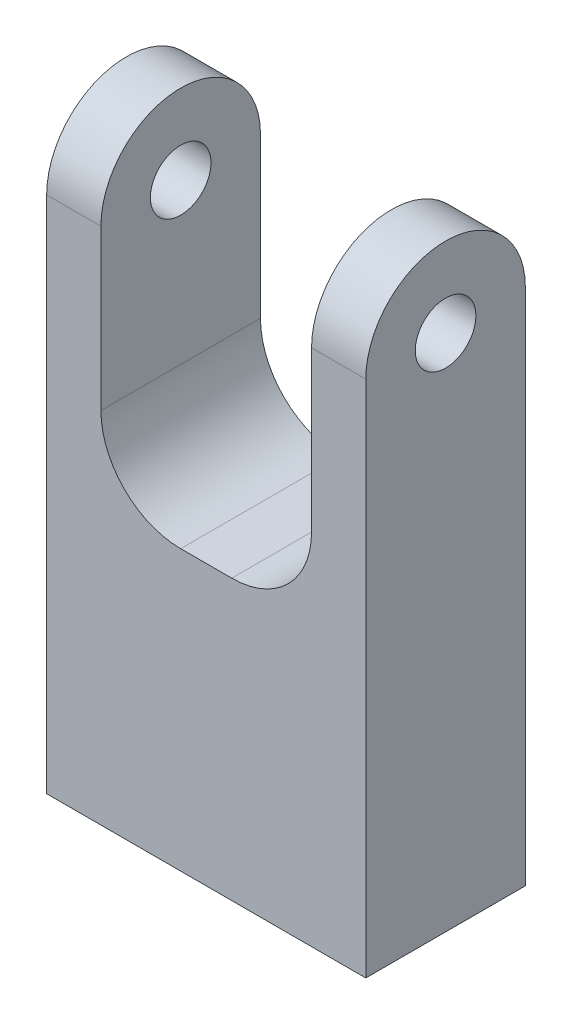
ISO-10303-21;
HEADER;
FILE_DESCRIPTION(('STEP AP214'),'2;1');
FILE_NAME('part.step','',(''),(''),'','','');
FILE_SCHEMA(('AUTOMOTIVE_DESIGN { 1 0 10303 214 1 1 1 1 }'));
ENDSEC;
DATA;
#1=APPLICATION_CONTEXT('core data for automotive mechanical design processes');
#2=APPLICATION_PROTOCOL_DEFINITION('international standard','automotive_design',2000,#1);
#3=PRODUCT_CONTEXT('',#1,'mechanical');
#4=PRODUCT('Part','Part','',(#3));
#5=PRODUCT_RELATED_PRODUCT_CATEGORY('part','',(#4));
#6=PRODUCT_DEFINITION_FORMATION('','',#4);
#7=PRODUCT_DEFINITION_CONTEXT('part definition',#1,'design');
#8=PRODUCT_DEFINITION('design','',#6,#7);
#9=PRODUCT_DEFINITION_SHAPE('','',#8);
#10=(LENGTH_UNIT() NAMED_UNIT(*) SI_UNIT(.MILLI.,.METRE.));
#11=(NAMED_UNIT(*) PLANE_ANGLE_UNIT() SI_UNIT($,.RADIAN.));
#12=(NAMED_UNIT(*) SI_UNIT($,.STERADIAN.) SOLID_ANGLE_UNIT());
#13=UNCERTAINTY_MEASURE_WITH_UNIT(LENGTH_MEASURE(1.E-05),#10,'distance_accuracy_value','');
#14=(GEOMETRIC_REPRESENTATION_CONTEXT(3) GLOBAL_UNCERTAINTY_ASSIGNED_CONTEXT((#13)) GLOBAL_UNIT_ASSIGNED_CONTEXT((#10,
#11,#12)) REPRESENTATION_CONTEXT('',''));
#15=CARTESIAN_POINT('',(0.,0.,0.));
#16=DIRECTION('',(0.,0.,1.));
#17=DIRECTION('',(1.,0.,0.));
#18=AXIS2_PLACEMENT_3D('',#15,#16,#17);
#19=CARTESIAN_POINT('',(8.38199999999999,41.275,0.));
#20=DIRECTION('',(-1.,0.,0.));
#21=DIRECTION('',(0.,-1.,0.));
#22=AXIS2_PLACEMENT_3D('',#19,#20,#21);
#23=CYLINDRICAL_SURFACE('',#22,6.35);
#24=DIRECTION('',(1.,0.,0.));
#25=VECTOR('',#24,1.);
#26=CARTESIAN_POINT('',(8.38199999999999,41.275,-6.35));
#27=LINE('',#26,#25);
#28=CARTESIAN_POINT('',(8.38199999999999,41.275,-6.35));
#29=VERTEX_POINT('',#28);
#30=CARTESIAN_POINT('',(12.7,41.275,-6.35));
#31=VERTEX_POINT('',#30);
#32=EDGE_CURVE('E214',#29,#31,#27,.T.);
#33=ORIENTED_EDGE('',*,*,#32,.F.);
#34=CARTESIAN_POINT('',(8.38199999999999,41.275,0.));
#35=DIRECTION('',(1.,0.,0.));
#36=DIRECTION('',(0.,1.,0.));
#37=AXIS2_PLACEMENT_3D('',#34,#35,#36);
#38=CIRCLE('',#37,6.35);
#39=CARTESIAN_POINT('',(8.38199999999999,41.275,6.35));
#40=VERTEX_POINT('',#39);
#41=EDGE_CURVE('E50',#40,#29,#38,.F.);
#42=ORIENTED_EDGE('',*,*,#41,.F.);
#43=DIRECTION('',(-1.,0.,0.));
#44=VECTOR('',#43,1.);
#45=CARTESIAN_POINT('',(0.,41.275,6.35));
#46=LINE('',#45,#44);
#47=CARTESIAN_POINT('',(12.7,41.275,6.35));
#48=VERTEX_POINT('',#47);
#49=EDGE_CURVE('E217',#48,#40,#46,.T.);
#50=ORIENTED_EDGE('',*,*,#49,.F.);
#51=CARTESIAN_POINT('',(12.7,41.275,0.));
#52=DIRECTION('',(-1.,0.,0.));
#53=DIRECTION('',(0.,-1.,0.));
#54=AXIS2_PLACEMENT_3D('',#51,#52,#53);
#55=CIRCLE('',#54,6.35);
#56=EDGE_CURVE('E11',#31,#48,#55,.F.);
#57=ORIENTED_EDGE('',*,*,#56,.F.);
#58=EDGE_LOOP('',(#33,#42,#50,#57));
#59=FACE_BOUND('',#58,.T.);
#60=ADVANCED_FACE('F42',(#59),#23,.T.);
#61=CARTESIAN_POINT('',(-12.7,41.275,0.));
#62=DIRECTION('',(-1.,0.,0.));
#63=DIRECTION('',(0.,-1.,0.));
#64=AXIS2_PLACEMENT_3D('',#61,#62,#63);
#65=CYLINDRICAL_SURFACE('',#64,6.35);
#66=DIRECTION('',(1.,0.,0.));
#67=VECTOR('',#66,1.);
#68=CARTESIAN_POINT('',(-12.7,41.275,-6.35));
#69=LINE('',#68,#67);
#70=CARTESIAN_POINT('',(-12.7,41.275,-6.35));
#71=VERTEX_POINT('',#70);
#72=CARTESIAN_POINT('',(-8.38199999999999,41.275,-6.35));
#73=VERTEX_POINT('',#72);
#74=EDGE_CURVE('E203',#71,#73,#69,.T.);
#75=ORIENTED_EDGE('',*,*,#74,.F.);
#76=CARTESIAN_POINT('',(-12.7,41.275,0.));
#77=DIRECTION('',(1.,0.,0.));
#78=DIRECTION('',(0.,1.,0.));
#79=AXIS2_PLACEMENT_3D('',#76,#77,#78);
#80=CIRCLE('',#79,6.35);
#81=CARTESIAN_POINT('',(-12.7,41.275,6.35));
#82=VERTEX_POINT('',#81);
#83=EDGE_CURVE('E212',#82,#71,#80,.F.);
#84=ORIENTED_EDGE('',*,*,#83,.F.);
#85=DIRECTION('',(-1.,0.,0.));
#86=VECTOR('',#85,1.);
#87=CARTESIAN_POINT('',(0.,41.275,6.35));
#88=LINE('',#87,#86);
#89=CARTESIAN_POINT('',(-8.38199999999999,41.275,6.35));
#90=VERTEX_POINT('',#89);
#91=EDGE_CURVE('E209',#90,#82,#88,.T.);
#92=ORIENTED_EDGE('',*,*,#91,.F.);
#93=CARTESIAN_POINT('',(-8.38199999999999,41.275,0.));
#94=DIRECTION('',(-1.,0.,0.));
#95=DIRECTION('',(0.,-1.,0.));
#96=AXIS2_PLACEMENT_3D('',#93,#94,#95);
#97=CIRCLE('',#96,6.35);
#98=EDGE_CURVE('E206',#73,#90,#97,.F.);
#99=ORIENTED_EDGE('',*,*,#98,.F.);
#100=EDGE_LOOP('',(#75,#84,#92,#99));
#101=FACE_BOUND('',#100,.T.);
#102=ADVANCED_FACE('F247',(#101),#65,.T.);
#103=CARTESIAN_POINT('',(-12.7,0.,6.35));
#104=DIRECTION('',(1.,0.,0.));
#105=DIRECTION('',(0.,1.,0.));
#106=AXIS2_PLACEMENT_3D('',#103,#104,#105);
#107=PLANE('',#106);
#108=CARTESIAN_POINT('',(-12.7,41.275,0.));
#109=DIRECTION('',(1.,0.,0.));
#110=DIRECTION('',(0.,0.,-1.));
#111=AXIS2_PLACEMENT_3D('',#108,#109,#110);
#112=CIRCLE('',#111,2.41299999999999);
#113=CARTESIAN_POINT('',(-12.7,41.275,-2.41299999999999));
#114=VERTEX_POINT('',#113);
#115=EDGE_CURVE('E183',#114,#114,#112,.T.);
#116=ORIENTED_EDGE('',*,*,#115,.T.);
#117=EDGE_LOOP('',(#116));
#118=FACE_BOUND('',#117,.T.);
#119=DIRECTION('',(0.,-1.,0.));
#120=VECTOR('',#119,1.);
#121=CARTESIAN_POINT('',(-12.7,0.,6.35));
#122=LINE('',#121,#120);
#123=CARTESIAN_POINT('',(-12.7,0.,6.35));
#124=VERTEX_POINT('',#123);
#125=EDGE_CURVE('E145',#82,#124,#122,.T.);
#126=ORIENTED_EDGE('',*,*,#125,.F.);
#127=ORIENTED_EDGE('',*,*,#83,.T.);
#128=DIRECTION('',(0.,-1.,0.));
#129=VECTOR('',#128,1.);
#130=CARTESIAN_POINT('',(-12.7,0.,-6.35));
#131=LINE('',#130,#129);
#132=CARTESIAN_POINT('',(-12.7,0.,-6.35));
#133=VERTEX_POINT('',#132);
#134=EDGE_CURVE('E144',#71,#133,#131,.T.);
#135=ORIENTED_EDGE('',*,*,#134,.T.);
#136=DIRECTION('',(0.,0.,-1.));
#137=VECTOR('',#136,1.);
#138=CARTESIAN_POINT('',(-12.7,0.,6.35));
#139=LINE('',#138,#137);
#140=EDGE_CURVE('E176',#124,#133,#139,.T.);
#141=ORIENTED_EDGE('',*,*,#140,.F.);
#142=EDGE_LOOP('',(#126,#127,#135,#141));
#143=FACE_BOUND('',#142,.T.);
#144=ADVANCED_FACE('F253',(#118,#143),#107,.F.);
#145=CARTESIAN_POINT('',(-12.7,0.,6.35));
#146=DIRECTION('',(0.,1.,0.));
#147=DIRECTION('',(-1.,0.,0.));
#148=AXIS2_PLACEMENT_3D('',#145,#146,#147);
#149=PLANE('',#148);
#150=CARTESIAN_POINT('',(9.525,0.,0.));
#151=DIRECTION('',(0.,-1.,0.));
#152=DIRECTION('',(0.,0.,-1.));
#153=AXIS2_PLACEMENT_3D('',#150,#151,#152);
#154=CIRCLE('',#153,1.35254999999999);
#155=CARTESIAN_POINT('',(9.525,0.,-1.35254999999999));
#156=VERTEX_POINT('',#155);
#157=EDGE_CURVE('E132',#156,#156,#154,.T.);
#158=ORIENTED_EDGE('',*,*,#157,.F.);
#159=EDGE_LOOP('',(#158));
#160=FACE_BOUND('',#159,.T.);
#161=CARTESIAN_POINT('',(-9.525,0.,0.));
#162=DIRECTION('',(0.,-1.,0.));
#163=DIRECTION('',(0.,0.,-1.));
#164=AXIS2_PLACEMENT_3D('',#161,#162,#163);
#165=CIRCLE('',#164,1.35254999999999);
#166=CARTESIAN_POINT('',(-9.525,0.,-1.35254999999999));
#167=VERTEX_POINT('',#166);
#168=EDGE_CURVE('E131',#167,#167,#165,.T.);
#169=ORIENTED_EDGE('',*,*,#168,.F.);
#170=EDGE_LOOP('',(#169));
#171=FACE_BOUND('',#170,.T.);
#172=DIRECTION('',(1.,0.,0.));
#173=VECTOR('',#172,1.);
#174=CARTESIAN_POINT('',(-12.7,0.,-6.35));
#175=LINE('',#174,#173);
#176=CARTESIAN_POINT('',(12.7,0.,-6.35));
#177=VERTEX_POINT('',#176);
#178=EDGE_CURVE('E163',#133,#177,#175,.T.);
#179=ORIENTED_EDGE('',*,*,#178,.T.);
#180=DIRECTION('',(0.,0.,-1.));
#181=VECTOR('',#180,1.);
#182=CARTESIAN_POINT('',(12.7,0.,6.35));
#183=LINE('',#182,#181);
#184=CARTESIAN_POINT('',(12.7,0.,6.35));
#185=VERTEX_POINT('',#184);
#186=EDGE_CURVE('E161',#185,#177,#183,.T.);
#187=ORIENTED_EDGE('',*,*,#186,.F.);
#188=DIRECTION('',(1.,0.,0.));
#189=VECTOR('',#188,1.);
#190=CARTESIAN_POINT('',(-12.7,0.,6.35));
#191=LINE('',#190,#189);
#192=EDGE_CURVE('E147',#124,#185,#191,.T.);
#193=ORIENTED_EDGE('',*,*,#192,.F.);
#194=ORIENTED_EDGE('',*,*,#140,.T.);
#195=EDGE_LOOP('',(#179,#187,#193,#194));
#196=FACE_BOUND('',#195,.T.);
#197=ADVANCED_FACE('F257',(#160,#171,#196),#149,.F.);
#198=CARTESIAN_POINT('',(12.7,0.,6.35));
#199=DIRECTION('',(-1.,0.,0.));
#200=DIRECTION('',(0.,-1.,0.));
#201=AXIS2_PLACEMENT_3D('',#198,#199,#200);
#202=PLANE('',#201);
#203=CARTESIAN_POINT('',(12.7,41.275,0.));
#204=DIRECTION('',(1.,0.,0.));
#205=DIRECTION('',(0.,0.,-1.));
#206=AXIS2_PLACEMENT_3D('',#203,#204,#205);
#207=CIRCLE('',#206,2.413);
#208=CARTESIAN_POINT('',(12.7,41.275,-2.413));
#209=VERTEX_POINT('',#208);
#210=EDGE_CURVE('E429',#209,#209,#207,.T.);
#211=ORIENTED_EDGE('',*,*,#210,.F.);
#212=EDGE_LOOP('',(#211));
#213=FACE_BOUND('',#212,.T.);
#214=DIRECTION('',(0.,1.,0.));
#215=VECTOR('',#214,1.);
#216=CARTESIAN_POINT('',(12.7,0.,-6.35));
#217=LINE('',#216,#215);
#218=EDGE_CURVE('E165',#177,#31,#217,.T.);
#219=ORIENTED_EDGE('',*,*,#218,.T.);
#220=ORIENTED_EDGE('',*,*,#56,.T.);
#221=DIRECTION('',(0.,1.,0.));
#222=VECTOR('',#221,1.);
#223=CARTESIAN_POINT('',(12.7,0.,6.35));
#224=LINE('',#223,#222);
#225=EDGE_CURVE('E150',#185,#48,#224,.T.);
#226=ORIENTED_EDGE('',*,*,#225,.F.);
#227=ORIENTED_EDGE('',*,*,#186,.T.);
#228=EDGE_LOOP('',(#219,#220,#226,#227));
#229=FACE_BOUND('',#228,.T.);
#230=ADVANCED_FACE('F258',(#213,#229),#202,.F.);
#231=CARTESIAN_POINT('',(8.38199999999999,47.625,6.35));
#232=DIRECTION('',(1.,0.,0.));
#233=DIRECTION('',(0.,1.,0.));
#234=AXIS2_PLACEMENT_3D('',#231,#232,#233);
#235=PLANE('',#234);
#236=CARTESIAN_POINT('',(8.38199999999999,41.275,0.));
#237=DIRECTION('',(1.,0.,0.));
#238=DIRECTION('',(0.,1.,0.));
#239=AXIS2_PLACEMENT_3D('',#236,#237,#238);
#240=CIRCLE('',#239,2.41299999999999);
#241=CARTESIAN_POINT('',(8.38199999999999,43.688,0.));
#242=VERTEX_POINT('',#241);
#243=EDGE_CURVE('E180',#242,#242,#240,.T.);
#244=ORIENTED_EDGE('',*,*,#243,.T.);
#245=EDGE_LOOP('',(#244));
#246=FACE_BOUND('',#245,.T.);
#247=DIRECTION('',(0.,-1.,0.));
#248=VECTOR('',#247,1.);
#249=CARTESIAN_POINT('',(8.38199999999999,47.625,6.35));
#250=LINE('',#249,#248);
#251=CARTESIAN_POINT('',(8.38199999999999,28.575,6.35));
#252=VERTEX_POINT('',#251);
#253=EDGE_CURVE('E153',#40,#252,#250,.T.);
#254=ORIENTED_EDGE('',*,*,#253,.F.);
#255=ORIENTED_EDGE('',*,*,#41,.T.);
#256=DIRECTION('',(0.,-1.,0.));
#257=VECTOR('',#256,1.);
#258=CARTESIAN_POINT('',(8.38199999999999,47.625,-6.35));
#259=LINE('',#258,#257);
#260=CARTESIAN_POINT('',(8.38199999999999,28.575,-6.35));
#261=VERTEX_POINT('',#260);
#262=EDGE_CURVE('E167',#29,#261,#259,.T.);
#263=ORIENTED_EDGE('',*,*,#262,.T.);
#264=DIRECTION('',(0.,0.,-1.));
#265=VECTOR('',#264,1.);
#266=CARTESIAN_POINT('',(8.38199999999999,28.575,6.35));
#267=LINE('',#266,#265);
#268=EDGE_CURVE('E191',#261,#252,#267,.F.);
#269=ORIENTED_EDGE('',*,*,#268,.T.);
#270=EDGE_LOOP('',(#254,#255,#263,#269));
#271=FACE_BOUND('',#270,.T.);
#272=ADVANCED_FACE('F220',(#246,#271),#235,.F.);
#273=CARTESIAN_POINT('',(-8.38199999999999,22.225,6.35));
#274=DIRECTION('',(0.,-1.,0.));
#275=DIRECTION('',(1.,0.,0.));
#276=AXIS2_PLACEMENT_3D('',#273,#274,#275);
#277=PLANE('',#276);
#278=DIRECTION('',(-1.,0.,0.));
#279=VECTOR('',#278,1.);
#280=CARTESIAN_POINT('',(-8.38199999999999,22.225,-6.35));
#281=LINE('',#280,#279);
#282=CARTESIAN_POINT('',(2.03199999999999,22.225,-6.35));
#283=VERTEX_POINT('',#282);
#284=CARTESIAN_POINT('',(-2.03199999999999,22.225,-6.35));
#285=VERTEX_POINT('',#284);
#286=EDGE_CURVE('E169',#283,#285,#281,.T.);
#287=ORIENTED_EDGE('',*,*,#286,.T.);
#288=DIRECTION('',(0.,0.,-1.));
#289=VECTOR('',#288,1.);
#290=CARTESIAN_POINT('',(-2.03199999999999,22.225,6.35));
#291=LINE('',#290,#289);
#292=CARTESIAN_POINT('',(-2.03199999999999,22.225,6.35));
#293=VERTEX_POINT('',#292);
#294=EDGE_CURVE('E189',#285,#293,#291,.F.);
#295=ORIENTED_EDGE('',*,*,#294,.T.);
#296=DIRECTION('',(-1.,0.,0.));
#297=VECTOR('',#296,1.);
#298=CARTESIAN_POINT('',(-8.38199999999999,22.225,6.35));
#299=LINE('',#298,#297);
#300=CARTESIAN_POINT('',(2.03199999999999,22.225,6.35));
#301=VERTEX_POINT('',#300);
#302=EDGE_CURVE('E155',#301,#293,#299,.T.);
#303=ORIENTED_EDGE('',*,*,#302,.F.);
#304=DIRECTION('',(0.,0.,-1.));
#305=VECTOR('',#304,1.);
#306=CARTESIAN_POINT('',(2.03199999999999,22.225,-6.35));
#307=LINE('',#306,#305);
#308=EDGE_CURVE('E186',#301,#283,#307,.T.);
#309=ORIENTED_EDGE('',*,*,#308,.T.);
#310=EDGE_LOOP('',(#287,#295,#303,#309));
#311=FACE_BOUND('',#310,.T.);
#312=ADVANCED_FACE('F236',(#311),#277,.F.);
#313=CARTESIAN_POINT('',(-8.38199999999999,47.625,6.35));
#314=DIRECTION('',(-1.,0.,0.));
#315=DIRECTION('',(0.,-1.,0.));
#316=AXIS2_PLACEMENT_3D('',#313,#314,#315);
#317=PLANE('',#316);
#318=CARTESIAN_POINT('',(-8.38199999999999,41.275,0.));
#319=DIRECTION('',(-1.,0.,0.));
#320=DIRECTION('',(0.,-1.,0.));
#321=AXIS2_PLACEMENT_3D('',#318,#319,#320);
#322=CIRCLE('',#321,2.41299999999999);
#323=CARTESIAN_POINT('',(-8.38199999999999,38.862,0.));
#324=VERTEX_POINT('',#323);
#325=EDGE_CURVE('E138',#324,#324,#322,.T.);
#326=ORIENTED_EDGE('',*,*,#325,.T.);
#327=EDGE_LOOP('',(#326));
#328=FACE_BOUND('',#327,.T.);
#329=DIRECTION('',(0.,1.,0.));
#330=VECTOR('',#329,1.);
#331=CARTESIAN_POINT('',(-8.38199999999999,47.625,-6.35));
#332=LINE('',#331,#330);
#333=CARTESIAN_POINT('',(-8.38199999999999,28.575,-6.35));
#334=VERTEX_POINT('',#333);
#335=EDGE_CURVE('E148',#334,#73,#332,.T.);
#336=ORIENTED_EDGE('',*,*,#335,.T.);
#337=ORIENTED_EDGE('',*,*,#98,.T.);
#338=DIRECTION('',(0.,1.,0.));
#339=VECTOR('',#338,1.);
#340=CARTESIAN_POINT('',(-8.38199999999999,47.625,6.35));
#341=LINE('',#340,#339);
#342=CARTESIAN_POINT('',(-8.38199999999999,28.575,6.35));
#343=VERTEX_POINT('',#342);
#344=EDGE_CURVE('E158',#343,#90,#341,.T.);
#345=ORIENTED_EDGE('',*,*,#344,.F.);
#346=DIRECTION('',(0.,0.,-1.));
#347=VECTOR('',#346,1.);
#348=CARTESIAN_POINT('',(-8.38199999999999,28.575,-6.35));
#349=LINE('',#348,#347);
#350=EDGE_CURVE('E179',#343,#334,#349,.T.);
#351=ORIENTED_EDGE('',*,*,#350,.T.);
#352=EDGE_LOOP('',(#336,#337,#345,#351));
#353=FACE_BOUND('',#352,.T.);
#354=ADVANCED_FACE('F243',(#328,#353),#317,.F.);
#355=CARTESIAN_POINT('',(0.,0.,6.35));
#356=DIRECTION('',(0.,0.,-1.));
#357=DIRECTION('',(-1.,0.,0.));
#358=AXIS2_PLACEMENT_3D('',#355,#356,#357);
#359=PLANE('',#358);
#360=ORIENTED_EDGE('',*,*,#225,.T.);
#361=ORIENTED_EDGE('',*,*,#49,.T.);
#362=ORIENTED_EDGE('',*,*,#253,.T.);
#363=CARTESIAN_POINT('',(2.03199999999999,28.575,6.35));
#364=DIRECTION('',(0.,0.,-1.));
#365=DIRECTION('',(-1.,0.,0.));
#366=AXIS2_PLACEMENT_3D('',#363,#364,#365);
#367=CIRCLE('',#366,6.35);
#368=EDGE_CURVE('E201',#252,#301,#367,.T.);
#369=ORIENTED_EDGE('',*,*,#368,.T.);
#370=ORIENTED_EDGE('',*,*,#302,.T.);
#371=CARTESIAN_POINT('',(-2.03199999999999,28.575,6.35));
#372=DIRECTION('',(0.,0.,-1.));
#373=DIRECTION('',(-1.,0.,0.));
#374=AXIS2_PLACEMENT_3D('',#371,#372,#373);
#375=CIRCLE('',#374,6.35);
#376=EDGE_CURVE('E196',#293,#343,#375,.T.);
#377=ORIENTED_EDGE('',*,*,#376,.T.);
#378=ORIENTED_EDGE('',*,*,#344,.T.);
#379=ORIENTED_EDGE('',*,*,#91,.T.);
#380=ORIENTED_EDGE('',*,*,#125,.T.);
#381=ORIENTED_EDGE('',*,*,#192,.T.);
#382=EDGE_LOOP('',(#360,#361,#362,#369,#370,#377,#378,#379,#380,#381));
#383=FACE_BOUND('',#382,.T.);
#384=ADVANCED_FACE('F233',(#383),#359,.F.);
#385=CARTESIAN_POINT('',(0.,0.,-6.35));
#386=DIRECTION('',(0.,0.,-1.));
#387=DIRECTION('',(-1.,0.,0.));
#388=AXIS2_PLACEMENT_3D('',#385,#386,#387);
#389=PLANE('',#388);
#390=ORIENTED_EDGE('',*,*,#262,.F.);
#391=ORIENTED_EDGE('',*,*,#32,.T.);
#392=ORIENTED_EDGE('',*,*,#218,.F.);
#393=ORIENTED_EDGE('',*,*,#178,.F.);
#394=ORIENTED_EDGE('',*,*,#134,.F.);
#395=ORIENTED_EDGE('',*,*,#74,.T.);
#396=ORIENTED_EDGE('',*,*,#335,.F.);
#397=CARTESIAN_POINT('',(-2.03199999999999,28.575,-6.35));
#398=DIRECTION('',(0.,0.,-1.));
#399=DIRECTION('',(-1.,0.,0.));
#400=AXIS2_PLACEMENT_3D('',#397,#398,#399);
#401=CIRCLE('',#400,6.35);
#402=EDGE_CURVE('E194',#334,#285,#401,.F.);
#403=ORIENTED_EDGE('',*,*,#402,.T.);
#404=ORIENTED_EDGE('',*,*,#286,.F.);
#405=CARTESIAN_POINT('',(2.03199999999999,28.575,-6.35));
#406=DIRECTION('',(0.,0.,-1.));
#407=DIRECTION('',(-1.,0.,0.));
#408=AXIS2_PLACEMENT_3D('',#405,#406,#407);
#409=CIRCLE('',#408,6.35);
#410=EDGE_CURVE('E198',#283,#261,#409,.F.);
#411=ORIENTED_EDGE('',*,*,#410,.T.);
#412=EDGE_LOOP('',(#390,#391,#392,#393,#394,#395,#396,#403,#404,#411));
#413=FACE_BOUND('',#412,.T.);
#414=ADVANCED_FACE('F224',(#413),#389,.T.);
#415=CARTESIAN_POINT('',(-9.525,8.636,0.));
#416=DIRECTION('',(0.,-1.,0.));
#417=DIRECTION('',(0.,0.,-1.));
#418=AXIS2_PLACEMENT_3D('',#415,#416,#417);
#419=CONICAL_SURFACE('',#418,1.35255,1.02974425867665);
#420=CARTESIAN_POINT('',(-9.525,9.44869403026573,0.));
#421=VERTEX_POINT('',#420);
#422=VERTEX_LOOP('',#421);
#423=FACE_BOUND('',#422,.T.);
#424=CARTESIAN_POINT('',(-9.525,8.636,0.));
#425=DIRECTION('',(0.,-1.,0.));
#426=DIRECTION('',(0.,0.,-1.));
#427=AXIS2_PLACEMENT_3D('',#424,#425,#426);
#428=CIRCLE('',#427,1.35255);
#429=CARTESIAN_POINT('',(-9.525,8.636,-1.35255));
#430=VERTEX_POINT('',#429);
#431=EDGE_CURVE('E135',#430,#430,#428,.T.);
#432=ORIENTED_EDGE('',*,*,#431,.T.);
#433=EDGE_LOOP('',(#432));
#434=FACE_BOUND('',#433,.T.);
#435=ADVANCED_FACE('F305',(#423,#434),#419,.F.);
#436=CARTESIAN_POINT('',(-9.525,0.,0.));
#437=DIRECTION('',(0.,-1.,0.));
#438=DIRECTION('',(0.,0.,-1.));
#439=AXIS2_PLACEMENT_3D('',#436,#437,#438);
#440=CYLINDRICAL_SURFACE('',#439,1.35254999999999);
#441=ORIENTED_EDGE('',*,*,#431,.F.);
#442=EDGE_LOOP('',(#441));
#443=FACE_BOUND('',#442,.T.);
#444=ORIENTED_EDGE('',*,*,#168,.T.);
#445=EDGE_LOOP('',(#444));
#446=FACE_BOUND('',#445,.T.);
#447=ADVANCED_FACE('F125',(#443,#446),#440,.F.);
#448=CARTESIAN_POINT('',(9.525,8.636,0.));
#449=DIRECTION('',(0.,-1.,0.));
#450=DIRECTION('',(0.,0.,-1.));
#451=AXIS2_PLACEMENT_3D('',#448,#449,#450);
#452=CONICAL_SURFACE('',#451,1.35255,1.02974425867665);
#453=CARTESIAN_POINT('',(9.525,9.44869403026573,0.));
#454=VERTEX_POINT('',#453);
#455=VERTEX_LOOP('',#454);
#456=FACE_BOUND('',#455,.T.);
#457=CARTESIAN_POINT('',(9.525,8.636,0.));
#458=DIRECTION('',(0.,-1.,0.));
#459=DIRECTION('',(0.,0.,-1.));
#460=AXIS2_PLACEMENT_3D('',#457,#458,#459);
#461=CIRCLE('',#460,1.35255);
#462=CARTESIAN_POINT('',(9.525,8.636,-1.35255));
#463=VERTEX_POINT('',#462);
#464=EDGE_CURVE('E129',#463,#463,#461,.T.);
#465=ORIENTED_EDGE('',*,*,#464,.T.);
#466=EDGE_LOOP('',(#465));
#467=FACE_BOUND('',#466,.T.);
#468=ADVANCED_FACE('F121',(#456,#467),#452,.F.);
#469=CARTESIAN_POINT('',(9.525,0.,0.));
#470=DIRECTION('',(0.,-1.,0.));
#471=DIRECTION('',(0.,0.,-1.));
#472=AXIS2_PLACEMENT_3D('',#469,#470,#471);
#473=CYLINDRICAL_SURFACE('',#472,1.35254999999999);
#474=ORIENTED_EDGE('',*,*,#464,.F.);
#475=EDGE_LOOP('',(#474));
#476=FACE_BOUND('',#475,.T.);
#477=ORIENTED_EDGE('',*,*,#157,.T.);
#478=EDGE_LOOP('',(#477));
#479=FACE_BOUND('',#478,.T.);
#480=ADVANCED_FACE('F124',(#476,#479),#473,.F.);
#481=CARTESIAN_POINT('',(12.7,41.275,0.));
#482=DIRECTION('',(1.,0.,0.));
#483=DIRECTION('',(0.,0.,-1.));
#484=AXIS2_PLACEMENT_3D('',#481,#482,#483);
#485=CYLINDRICAL_SURFACE('',#484,2.41299999999999);
#486=ORIENTED_EDGE('',*,*,#210,.T.);
#487=EDGE_LOOP('',(#486));
#488=FACE_BOUND('',#487,.T.);
#489=ORIENTED_EDGE('',*,*,#243,.F.);
#490=EDGE_LOOP('',(#489));
#491=FACE_BOUND('',#490,.T.);
#492=ADVANCED_FACE('F291',(#488,#491),#485,.F.);
#493=ORIENTED_EDGE('',*,*,#115,.F.);
#494=EDGE_LOOP('',(#493));
#495=FACE_BOUND('',#494,.T.);
#496=ORIENTED_EDGE('',*,*,#325,.F.);
#497=EDGE_LOOP('',(#496));
#498=FACE_BOUND('',#497,.T.);
#499=ADVANCED_FACE('F287',(#495,#498),#485,.F.);
#500=CARTESIAN_POINT('',(-2.03199999999999,28.575,6.35));
#501=DIRECTION('',(0.,0.,1.));
#502=DIRECTION('',(1.,0.,0.));
#503=AXIS2_PLACEMENT_3D('',#500,#501,#502);
#504=CYLINDRICAL_SURFACE('',#503,6.35);
#505=ORIENTED_EDGE('',*,*,#376,.F.);
#506=ORIENTED_EDGE('',*,*,#294,.F.);
#507=ORIENTED_EDGE('',*,*,#402,.F.);
#508=ORIENTED_EDGE('',*,*,#350,.F.);
#509=EDGE_LOOP('',(#505,#506,#507,#508));
#510=FACE_BOUND('',#509,.T.);
#511=ADVANCED_FACE('F239',(#510),#504,.F.);
#512=CARTESIAN_POINT('',(2.03199999999999,28.575,6.35));
#513=DIRECTION('',(0.,0.,1.));
#514=DIRECTION('',(1.,0.,0.));
#515=AXIS2_PLACEMENT_3D('',#512,#513,#514);
#516=CYLINDRICAL_SURFACE('',#515,6.35);
#517=ORIENTED_EDGE('',*,*,#368,.F.);
#518=ORIENTED_EDGE('',*,*,#268,.F.);
#519=ORIENTED_EDGE('',*,*,#410,.F.);
#520=ORIENTED_EDGE('',*,*,#308,.F.);
#521=EDGE_LOOP('',(#517,#518,#519,#520));
#522=FACE_BOUND('',#521,.T.);
#523=ADVANCED_FACE('F230',(#522),#516,.F.);
#524=CLOSED_SHELL('',(#60,#102,#144,#197,#230,#272,#312,#354,#384,#414,#435,#447,#468,#480,#492,
#499,#511,#523));
#525=MANIFOLD_SOLID_BREP('B2',#524);
#526=ADVANCED_BREP_SHAPE_REPRESENTATION('',(#18,#525),#14);
#527=SHAPE_DEFINITION_REPRESENTATION(#9,#526);
ENDSEC;
END-ISO-10303-21;
